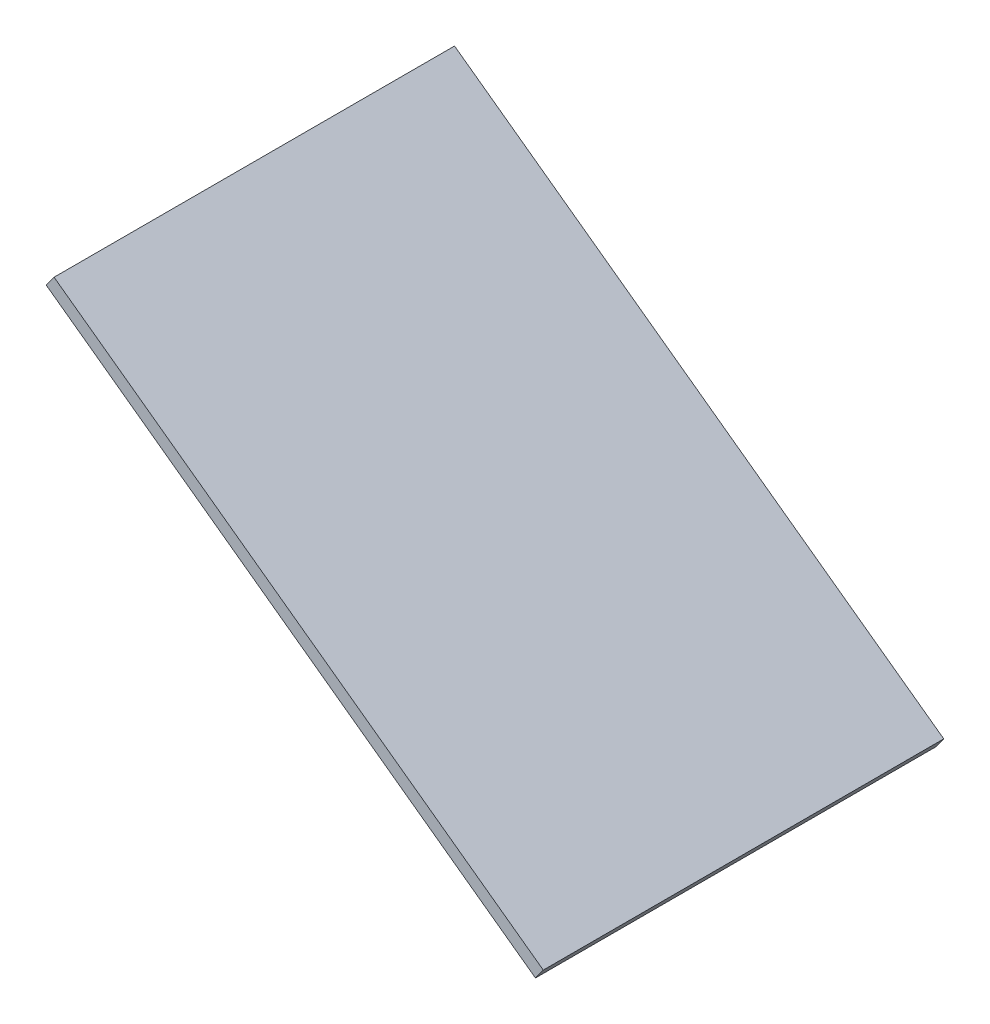
ISO-10303-21;
HEADER;
FILE_DESCRIPTION(('STEP AP214'),'2;1');
FILE_NAME('part.step','',(''),(''),'','','');
FILE_SCHEMA(('AUTOMOTIVE_DESIGN { 1 0 10303 214 1 1 1 1 }'));
ENDSEC;
DATA;
#1=APPLICATION_CONTEXT('core data for automotive mechanical design processes');
#2=APPLICATION_PROTOCOL_DEFINITION('international standard','automotive_design',2000,#1);
#3=PRODUCT_CONTEXT('',#1,'mechanical');
#4=PRODUCT('Part','Part','',(#3));
#5=PRODUCT_RELATED_PRODUCT_CATEGORY('part','',(#4));
#6=PRODUCT_DEFINITION_FORMATION('','',#4);
#7=PRODUCT_DEFINITION_CONTEXT('part definition',#1,'design');
#8=PRODUCT_DEFINITION('design','',#6,#7);
#9=PRODUCT_DEFINITION_SHAPE('','',#8);
#10=(LENGTH_UNIT() NAMED_UNIT(*) SI_UNIT(.MILLI.,.METRE.));
#11=(NAMED_UNIT(*) PLANE_ANGLE_UNIT() SI_UNIT($,.RADIAN.));
#12=(NAMED_UNIT(*) SI_UNIT($,.STERADIAN.) SOLID_ANGLE_UNIT());
#13=UNCERTAINTY_MEASURE_WITH_UNIT(LENGTH_MEASURE(1.E-05),#10,'distance_accuracy_value','');
#14=(GEOMETRIC_REPRESENTATION_CONTEXT(3) GLOBAL_UNCERTAINTY_ASSIGNED_CONTEXT((#13)) GLOBAL_UNIT_ASSIGNED_CONTEXT((#10,
#11,#12)) REPRESENTATION_CONTEXT('',''));
#15=CARTESIAN_POINT('',(0.,0.,0.));
#16=DIRECTION('',(0.,0.,1.));
#17=DIRECTION('',(1.,0.,0.));
#18=AXIS2_PLACEMENT_3D('',#15,#16,#17);
#19=CARTESIAN_POINT('',(-1265.76453722594,962.894145948148,-526.5));
#20=DIRECTION('',(0.,0.,-1.));
#21=DIRECTION('',(-1.,0.,0.));
#22=AXIS2_PLACEMENT_3D('',#19,#20,#21);
#23=PLANE('',#22);
#24=DIRECTION('',(0.809016994374951,-0.587785252292469,0.));
#25=VECTOR('',#24,1.);
#26=CARTESIAN_POINT('',(-1286.33702105617,934.578551145025,-526.5));
#27=LINE('',#26,#25);
#28=CARTESIAN_POINT('',(-1286.33702105617,934.578551145025,-526.5));
#29=VERTEX_POINT('',#28);
#30=CARTESIAN_POINT('',(0.,0.,-526.5));
#31=VERTEX_POINT('',#30);
#32=EDGE_CURVE('E141',#29,#31,#27,.T.);
#33=ORIENTED_EDGE('',*,*,#32,.F.);
#34=DIRECTION('',(-0.587785252292469,-0.809016994374951,0.));
#35=VECTOR('',#34,1.);
#36=CARTESIAN_POINT('',(-1265.76453722594,962.894145948148,-526.5));
#37=LINE('',#36,#35);
#38=CARTESIAN_POINT('',(-1265.76453722594,962.894145948148,-526.5));
#39=VERTEX_POINT('',#38);
#40=EDGE_CURVE('E11',#39,#29,#37,.T.);
#41=ORIENTED_EDGE('',*,*,#40,.F.);
#42=DIRECTION('',(0.809016994374951,-0.587785252292469,0.));
#43=VECTOR('',#42,1.);
#44=CARTESIAN_POINT('',(-1265.76453722594,962.894145948148,-526.5));
#45=LINE('',#44,#43);
#46=CARTESIAN_POINT('',(20.5724838302364,28.3155948031233,-526.5));
#47=VERTEX_POINT('',#46);
#48=EDGE_CURVE('E145',#39,#47,#45,.T.);
#49=ORIENTED_EDGE('',*,*,#48,.T.);
#50=DIRECTION('',(-0.587785252292469,-0.809016994374951,0.));
#51=VECTOR('',#50,1.);
#52=CARTESIAN_POINT('',(20.5724838302364,28.3155948031233,-526.5));
#53=LINE('',#52,#51);
#54=EDGE_CURVE('E37',#47,#31,#53,.T.);
#55=ORIENTED_EDGE('',*,*,#54,.T.);
#56=EDGE_LOOP('',(#33,#41,#49,#55));
#57=FACE_BOUND('',#56,.T.);
#58=ADVANCED_FACE('F34',(#57),#23,.T.);
#59=CARTESIAN_POINT('',(-1265.76453722594,962.894145948148,-526.5));
#60=DIRECTION('',(-0.809016994374951,0.587785252292469,0.));
#61=DIRECTION('',(-0.587785252292469,-0.809016994374951,0.));
#62=AXIS2_PLACEMENT_3D('',#59,#60,#61);
#63=PLANE('',#62);
#64=DIRECTION('',(0.,0.,-1.));
#65=VECTOR('',#64,1.);
#66=CARTESIAN_POINT('',(-1286.33702105617,934.578551145025,-526.5));
#67=LINE('',#66,#65);
#68=CARTESIAN_POINT('',(-1286.33702105617,934.578551145025,526.5));
#69=VERTEX_POINT('',#68);
#70=EDGE_CURVE('E148',#69,#29,#67,.T.);
#71=ORIENTED_EDGE('',*,*,#70,.F.);
#72=DIRECTION('',(-0.587785252292469,-0.809016994374951,0.));
#73=VECTOR('',#72,1.);
#74=CARTESIAN_POINT('',(-1265.76453722594,962.894145948148,526.5));
#75=LINE('',#74,#73);
#76=CARTESIAN_POINT('',(-1265.76453722594,962.894145948148,526.5));
#77=VERTEX_POINT('',#76);
#78=EDGE_CURVE('E42',#77,#69,#75,.T.);
#79=ORIENTED_EDGE('',*,*,#78,.F.);
#80=DIRECTION('',(0.,0.,-1.));
#81=VECTOR('',#80,1.);
#82=CARTESIAN_POINT('',(-1265.76453722594,962.894145948148,-526.5));
#83=LINE('',#82,#81);
#84=EDGE_CURVE('E153',#77,#39,#83,.T.);
#85=ORIENTED_EDGE('',*,*,#84,.T.);
#86=ORIENTED_EDGE('',*,*,#40,.T.);
#87=EDGE_LOOP('',(#71,#79,#85,#86));
#88=FACE_BOUND('',#87,.T.);
#89=ADVANCED_FACE('F170',(#88),#63,.T.);
#90=CARTESIAN_POINT('',(-1265.76453722594,962.894145948148,526.5));
#91=DIRECTION('',(0.,0.,1.));
#92=DIRECTION('',(1.,0.,0.));
#93=AXIS2_PLACEMENT_3D('',#90,#91,#92);
#94=PLANE('',#93);
#95=DIRECTION('',(-0.809016994374951,0.587785252292469,0.));
#96=VECTOR('',#95,1.);
#97=CARTESIAN_POINT('',(-1286.33702105617,934.578551145025,526.5));
#98=LINE('',#97,#96);
#99=CARTESIAN_POINT('',(-1.62525267318548E-13,1.13697042326956E-13,526.5));
#100=VERTEX_POINT('',#99);
#101=EDGE_CURVE('E160',#100,#69,#98,.T.);
#102=ORIENTED_EDGE('',*,*,#101,.F.);
#103=DIRECTION('',(-0.587785252292469,-0.809016994374951,0.));
#104=VECTOR('',#103,1.);
#105=CARTESIAN_POINT('',(20.5724838302362,28.3155948031234,526.5));
#106=LINE('',#105,#104);
#107=CARTESIAN_POINT('',(20.5724838302362,28.3155948031234,526.5));
#108=VERTEX_POINT('',#107);
#109=EDGE_CURVE('E165',#108,#100,#106,.T.);
#110=ORIENTED_EDGE('',*,*,#109,.F.);
#111=DIRECTION('',(-0.809016994374951,0.587785252292469,0.));
#112=VECTOR('',#111,1.);
#113=CARTESIAN_POINT('',(-1265.76453722594,962.894145948148,526.5));
#114=LINE('',#113,#112);
#115=EDGE_CURVE('E150',#108,#77,#114,.T.);
#116=ORIENTED_EDGE('',*,*,#115,.T.);
#117=ORIENTED_EDGE('',*,*,#78,.T.);
#118=EDGE_LOOP('',(#102,#110,#116,#117));
#119=FACE_BOUND('',#118,.T.);
#120=ADVANCED_FACE('F174',(#119),#94,.T.);
#121=CARTESIAN_POINT('',(20.5724838302364,28.3155948031233,-526.5));
#122=DIRECTION('',(0.809016994374951,-0.587785252292469,0.));
#123=DIRECTION('',(0.587785252292469,0.809016994374951,0.));
#124=AXIS2_PLACEMENT_3D('',#121,#122,#123);
#125=PLANE('',#124);
#126=DIRECTION('',(0.,0.,1.));
#127=VECTOR('',#126,1.);
#128=CARTESIAN_POINT('',(0.,0.,-526.5));
#129=LINE('',#128,#127);
#130=EDGE_CURVE('E157',#31,#100,#129,.T.);
#131=ORIENTED_EDGE('',*,*,#130,.F.);
#132=ORIENTED_EDGE('',*,*,#54,.F.);
#133=DIRECTION('',(0.,0.,1.));
#134=VECTOR('',#133,1.);
#135=CARTESIAN_POINT('',(20.5724838302364,28.3155948031233,-526.5));
#136=LINE('',#135,#134);
#137=EDGE_CURVE('E147',#47,#108,#136,.T.);
#138=ORIENTED_EDGE('',*,*,#137,.T.);
#139=ORIENTED_EDGE('',*,*,#109,.T.);
#140=EDGE_LOOP('',(#131,#132,#138,#139));
#141=FACE_BOUND('',#140,.T.);
#142=ADVANCED_FACE('F167',(#141),#125,.T.);
#143=CARTESIAN_POINT('',(20.5724838302364,28.3155948031233,0.));
#144=DIRECTION('',(-0.587785252292469,-0.809016994374951,0.));
#145=DIRECTION('',(0.809016994374951,-0.587785252292469,0.));
#146=AXIS2_PLACEMENT_3D('',#143,#144,#145);
#147=PLANE('',#146);
#148=ORIENTED_EDGE('',*,*,#48,.F.);
#149=ORIENTED_EDGE('',*,*,#84,.F.);
#150=ORIENTED_EDGE('',*,*,#115,.F.);
#151=ORIENTED_EDGE('',*,*,#137,.F.);
#152=EDGE_LOOP('',(#148,#149,#150,#151));
#153=FACE_BOUND('',#152,.T.);
#154=ADVANCED_FACE('F176',(#153),#147,.F.);
#155=CARTESIAN_POINT('',(0.,0.,0.));
#156=DIRECTION('',(-0.587785252292469,-0.809016994374951,0.));
#157=DIRECTION('',(0.809016994374951,-0.587785252292469,0.));
#158=AXIS2_PLACEMENT_3D('',#155,#156,#157);
#159=PLANE('',#158);
#160=DIRECTION('',(0.,0.,-1.));
#161=VECTOR('',#160,1.);
#162=CARTESIAN_POINT('',(-1258.02142625305,914.006067314789,-491.499999999999));
#163=LINE('',#162,#161);
#164=CARTESIAN_POINT('',(-1258.02142625305,914.006067314789,491.499999999999));
#165=VERTEX_POINT('',#164);
#166=CARTESIAN_POINT('',(-1258.02142625305,914.006067314789,-491.499999999999));
#167=VERTEX_POINT('',#166);
#168=EDGE_CURVE('E50',#165,#167,#163,.T.);
#169=ORIENTED_EDGE('',*,*,#168,.F.);
#170=DIRECTION('',(-0.809016994374951,0.587785252292469,0.));
#171=VECTOR('',#170,1.);
#172=CARTESIAN_POINT('',(-28.3155948031234,20.5724838302365,491.499999999999));
#173=LINE('',#172,#171);
#174=CARTESIAN_POINT('',(-28.3155948031234,20.5724838302365,491.499999999999));
#175=VERTEX_POINT('',#174);
#176=EDGE_CURVE('E126',#175,#165,#173,.T.);
#177=ORIENTED_EDGE('',*,*,#176,.F.);
#178=DIRECTION('',(0.,0.,1.));
#179=VECTOR('',#178,1.);
#180=CARTESIAN_POINT('',(-28.3155948031234,20.5724838302365,-491.499999999999));
#181=LINE('',#180,#179);
#182=CARTESIAN_POINT('',(-28.3155948031234,20.5724838302365,-491.499999999999));
#183=VERTEX_POINT('',#182);
#184=EDGE_CURVE('E129',#183,#175,#181,.T.);
#185=ORIENTED_EDGE('',*,*,#184,.F.);
#186=DIRECTION('',(0.809016994374951,-0.587785252292469,0.));
#187=VECTOR('',#186,1.);
#188=CARTESIAN_POINT('',(-28.3155948031234,20.5724838302365,-491.499999999999));
#189=LINE('',#188,#187);
#190=EDGE_CURVE('E135',#167,#183,#189,.T.);
#191=ORIENTED_EDGE('',*,*,#190,.F.);
#192=EDGE_LOOP('',(#169,#177,#185,#191));
#193=FACE_BOUND('',#192,.T.);
#194=ORIENTED_EDGE('',*,*,#32,.T.);
#195=ORIENTED_EDGE('',*,*,#130,.T.);
#196=ORIENTED_EDGE('',*,*,#101,.T.);
#197=ORIENTED_EDGE('',*,*,#70,.T.);
#198=EDGE_LOOP('',(#194,#195,#196,#197));
#199=FACE_BOUND('',#198,.T.);
#200=ADVANCED_FACE('F169',(#193,#199),#159,.T.);
#201=CARTESIAN_POINT('',(-1239.21229817969,939.894611134787,-491.499999999999));
#202=DIRECTION('',(-0.809016994374951,0.587785252292469,0.));
#203=DIRECTION('',(-0.587785252292469,-0.809016994374951,0.));
#204=AXIS2_PLACEMENT_3D('',#201,#202,#203);
#205=PLANE('',#204);
#206=ORIENTED_EDGE('',*,*,#168,.T.);
#207=DIRECTION('',(-0.587785252292469,-0.809016994374951,0.));
#208=VECTOR('',#207,1.);
#209=CARTESIAN_POINT('',(-1239.21229817969,939.894611134787,-491.499999999999));
#210=LINE('',#209,#208);
#211=CARTESIAN_POINT('',(-1239.21229817969,939.894611134787,-491.499999999999));
#212=VERTEX_POINT('',#211);
#213=EDGE_CURVE('E104',#212,#167,#210,.T.);
#214=ORIENTED_EDGE('',*,*,#213,.F.);
#215=DIRECTION('',(0.,0.,-1.));
#216=VECTOR('',#215,1.);
#217=CARTESIAN_POINT('',(-1239.21229817969,939.894611134787,-491.499999999999));
#218=LINE('',#217,#216);
#219=CARTESIAN_POINT('',(-1239.21229817969,939.894611134787,491.499999999999));
#220=VERTEX_POINT('',#219);
#221=EDGE_CURVE('E108',#220,#212,#218,.T.);
#222=ORIENTED_EDGE('',*,*,#221,.F.);
#223=DIRECTION('',(-0.587785252292469,-0.809016994374951,0.));
#224=VECTOR('',#223,1.);
#225=CARTESIAN_POINT('',(-1239.21229817969,939.894611134787,491.499999999999));
#226=LINE('',#225,#224);
#227=EDGE_CURVE('E139',#220,#165,#226,.T.);
#228=ORIENTED_EDGE('',*,*,#227,.T.);
#229=EDGE_LOOP('',(#206,#214,#222,#228));
#230=FACE_BOUND('',#229,.T.);
#231=ADVANCED_FACE('F106',(#230),#205,.F.);
#232=CARTESIAN_POINT('',(-9.5064667297644,46.4610276502349,491.499999999999));
#233=DIRECTION('',(0.,0.,1.));
#234=DIRECTION('',(0.,-1.,0.));
#235=AXIS2_PLACEMENT_3D('',#232,#233,#234);
#236=PLANE('',#235);
#237=ORIENTED_EDGE('',*,*,#176,.T.);
#238=ORIENTED_EDGE('',*,*,#227,.F.);
#239=DIRECTION('',(-0.809016994374951,0.587785252292469,0.));
#240=VECTOR('',#239,1.);
#241=CARTESIAN_POINT('',(-9.5064667297644,46.4610276502349,491.499999999999));
#242=LINE('',#241,#240);
#243=CARTESIAN_POINT('',(-9.5064667297644,46.4610276502349,491.499999999999));
#244=VERTEX_POINT('',#243);
#245=EDGE_CURVE('E114',#244,#220,#242,.T.);
#246=ORIENTED_EDGE('',*,*,#245,.F.);
#247=DIRECTION('',(-0.587785252292469,-0.809016994374951,0.));
#248=VECTOR('',#247,1.);
#249=CARTESIAN_POINT('',(-9.5064667297644,46.4610276502349,491.499999999999));
#250=LINE('',#249,#248);
#251=EDGE_CURVE('E142',#244,#175,#250,.T.);
#252=ORIENTED_EDGE('',*,*,#251,.T.);
#253=EDGE_LOOP('',(#237,#238,#246,#252));
#254=FACE_BOUND('',#253,.T.);
#255=ADVANCED_FACE('F222',(#254),#236,.F.);
#256=CARTESIAN_POINT('',(-9.5064667297644,46.4610276502349,-491.499999999999));
#257=DIRECTION('',(0.809016994374951,-0.587785252292469,0.));
#258=DIRECTION('',(0.587785252292469,0.809016994374951,0.));
#259=AXIS2_PLACEMENT_3D('',#256,#257,#258);
#260=PLANE('',#259);
#261=ORIENTED_EDGE('',*,*,#184,.T.);
#262=ORIENTED_EDGE('',*,*,#251,.F.);
#263=DIRECTION('',(0.,0.,1.));
#264=VECTOR('',#263,1.);
#265=CARTESIAN_POINT('',(-9.5064667297644,46.4610276502349,-491.499999999999));
#266=LINE('',#265,#264);
#267=CARTESIAN_POINT('',(-9.5064667297644,46.4610276502349,-491.499999999999));
#268=VERTEX_POINT('',#267);
#269=EDGE_CURVE('E122',#268,#244,#266,.T.);
#270=ORIENTED_EDGE('',*,*,#269,.F.);
#271=DIRECTION('',(-0.587785252292469,-0.809016994374951,0.));
#272=VECTOR('',#271,1.);
#273=CARTESIAN_POINT('',(-9.5064667297644,46.4610276502349,-491.499999999999));
#274=LINE('',#273,#272);
#275=EDGE_CURVE('E113',#268,#183,#274,.T.);
#276=ORIENTED_EDGE('',*,*,#275,.T.);
#277=EDGE_LOOP('',(#261,#262,#270,#276));
#278=FACE_BOUND('',#277,.T.);
#279=ADVANCED_FACE('F230',(#278),#260,.F.);
#280=CARTESIAN_POINT('',(-9.5064667297644,46.4610276502349,-491.499999999999));
#281=DIRECTION('',(0.,0.,-1.));
#282=DIRECTION('',(0.,1.,0.));
#283=AXIS2_PLACEMENT_3D('',#280,#281,#282);
#284=PLANE('',#283);
#285=ORIENTED_EDGE('',*,*,#190,.T.);
#286=ORIENTED_EDGE('',*,*,#275,.F.);
#287=DIRECTION('',(0.809016994374951,-0.587785252292469,0.));
#288=VECTOR('',#287,1.);
#289=CARTESIAN_POINT('',(-9.5064667297644,46.4610276502349,-491.499999999999));
#290=LINE('',#289,#288);
#291=EDGE_CURVE('E117',#212,#268,#290,.T.);
#292=ORIENTED_EDGE('',*,*,#291,.F.);
#293=ORIENTED_EDGE('',*,*,#213,.T.);
#294=EDGE_LOOP('',(#285,#286,#292,#293));
#295=FACE_BOUND('',#294,.T.);
#296=ADVANCED_FACE('F118',(#295),#284,.F.);
#297=CARTESIAN_POINT('',(18.8091280733591,25.8885438199985,0.));
#298=DIRECTION('',(-0.587785252292469,-0.809016994374951,0.));
#299=DIRECTION('',(0.809016994374951,-0.587785252292469,0.));
#300=AXIS2_PLACEMENT_3D('',#297,#298,#299);
#301=PLANE('',#300);
#302=ORIENTED_EDGE('',*,*,#221,.T.);
#303=ORIENTED_EDGE('',*,*,#291,.T.);
#304=ORIENTED_EDGE('',*,*,#269,.T.);
#305=ORIENTED_EDGE('',*,*,#245,.T.);
#306=EDGE_LOOP('',(#302,#303,#304,#305));
#307=FACE_BOUND('',#306,.T.);
#308=ADVANCED_FACE('F124',(#307),#301,.T.);
#309=CLOSED_SHELL('',(#58,#89,#120,#142,#154,#200,#231,#255,#279,#296,#308));
#310=MANIFOLD_SOLID_BREP('B2',#309);
#311=ADVANCED_BREP_SHAPE_REPRESENTATION('',(#18,#310),#14);
#312=SHAPE_DEFINITION_REPRESENTATION(#9,#311);
ENDSEC;
END-ISO-10303-21;
